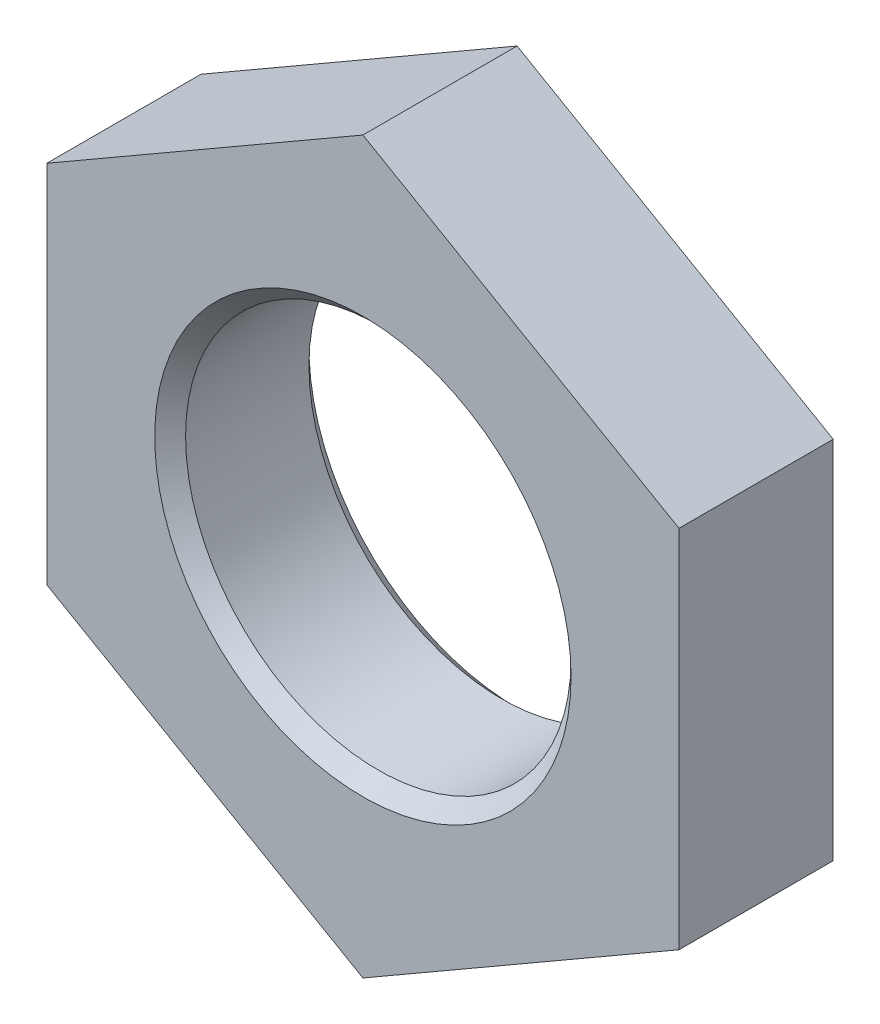
ISO-10303-21;
HEADER;
FILE_DESCRIPTION(('STEP AP214'),'2;1');
FILE_NAME('part.step','',(''),(''),'','','');
FILE_SCHEMA(('AUTOMOTIVE_DESIGN { 1 0 10303 214 1 1 1 1 }'));
ENDSEC;
DATA;
#1=APPLICATION_CONTEXT('core data for automotive mechanical design processes');
#2=APPLICATION_PROTOCOL_DEFINITION('international standard','automotive_design',2000,#1);
#3=PRODUCT_CONTEXT('',#1,'mechanical');
#4=PRODUCT('Part','Part','',(#3));
#5=PRODUCT_RELATED_PRODUCT_CATEGORY('part','',(#4));
#6=PRODUCT_DEFINITION_FORMATION('','',#4);
#7=PRODUCT_DEFINITION_CONTEXT('part definition',#1,'design');
#8=PRODUCT_DEFINITION('design','',#6,#7);
#9=PRODUCT_DEFINITION_SHAPE('','',#8);
#10=(LENGTH_UNIT() NAMED_UNIT(*) SI_UNIT(.MILLI.,.METRE.));
#11=(NAMED_UNIT(*) PLANE_ANGLE_UNIT() SI_UNIT($,.RADIAN.));
#12=(NAMED_UNIT(*) SI_UNIT($,.STERADIAN.) SOLID_ANGLE_UNIT());
#13=UNCERTAINTY_MEASURE_WITH_UNIT(LENGTH_MEASURE(1.E-05),#10,'distance_accuracy_value','');
#14=(GEOMETRIC_REPRESENTATION_CONTEXT(3) GLOBAL_UNCERTAINTY_ASSIGNED_CONTEXT((#13)) GLOBAL_UNIT_ASSIGNED_CONTEXT((#10,
#11,#12)) REPRESENTATION_CONTEXT('',''));
#15=CARTESIAN_POINT('',(0.,0.,0.));
#16=DIRECTION('',(0.,0.,1.));
#17=DIRECTION('',(1.,0.,0.));
#18=AXIS2_PLACEMENT_3D('',#15,#16,#17);
#19=CARTESIAN_POINT('',(0.,0.,2.));
#20=DIRECTION('',(0.,0.,1.));
#21=DIRECTION('',(1.,0.,0.));
#22=AXIS2_PLACEMENT_3D('',#19,#20,#21);
#23=PLANE('',#22);
#24=CARTESIAN_POINT('',(0.,0.,2.));
#25=DIRECTION('',(0.,0.,1.));
#26=DIRECTION('',(1.,0.,0.));
#27=AXIS2_PLACEMENT_3D('',#24,#25,#26);
#28=CIRCLE('',#27,2.7);
#29=CARTESIAN_POINT('',(2.7,0.,2.));
#30=VERTEX_POINT('',#29);
#31=EDGE_CURVE('E11',#30,#30,#28,.F.);
#32=ORIENTED_EDGE('',*,*,#31,.T.);
#33=EDGE_LOOP('',(#32));
#34=FACE_BOUND('',#33,.T.);
#35=DIRECTION('',(-0.866025403784441,0.499999999999995,0.));
#36=VECTOR('',#35,1.);
#37=CARTESIAN_POINT('',(4.09999999999997,2.36713610367751,2.));
#38=LINE('',#37,#36);
#39=CARTESIAN_POINT('',(4.09999999999997,2.36713610367751,2.));
#40=VERTEX_POINT('',#39);
#41=CARTESIAN_POINT('',(0.,4.73427220735493,2.));
#42=VERTEX_POINT('',#41);
#43=EDGE_CURVE('E148',#40,#42,#38,.T.);
#44=ORIENTED_EDGE('',*,*,#43,.T.);
#45=DIRECTION('',(-0.866025403784438,-0.500000000000001,0.));
#46=VECTOR('',#45,1.);
#47=CARTESIAN_POINT('',(0.,4.73427220735493,2.));
#48=LINE('',#47,#46);
#49=CARTESIAN_POINT('',(-4.10000000000001,2.36713610367746,2.));
#50=VERTEX_POINT('',#49);
#51=EDGE_CURVE('E98',#42,#50,#48,.T.);
#52=ORIENTED_EDGE('',*,*,#51,.T.);
#53=DIRECTION('',(0.,-1.,0.));
#54=VECTOR('',#53,1.);
#55=CARTESIAN_POINT('',(-4.10000000000001,2.36713610367746,2.));
#56=LINE('',#55,#54);
#57=CARTESIAN_POINT('',(-4.09999999999999,-2.36713610367749,2.));
#58=VERTEX_POINT('',#57);
#59=EDGE_CURVE('E110',#50,#58,#56,.T.);
#60=ORIENTED_EDGE('',*,*,#59,.T.);
#61=DIRECTION('',(0.866025403784442,-0.499999999999995,0.));
#62=VECTOR('',#61,1.);
#63=CARTESIAN_POINT('',(-4.09999999999999,-2.36713610367749,2.));
#64=LINE('',#63,#62);
#65=CARTESIAN_POINT('',(0.,-4.73427220735493,2.));
#66=VERTEX_POINT('',#65);
#67=EDGE_CURVE('E105',#58,#66,#64,.T.);
#68=ORIENTED_EDGE('',*,*,#67,.T.);
#69=DIRECTION('',(0.866025403784435,0.500000000000007,0.));
#70=VECTOR('',#69,1.);
#71=CARTESIAN_POINT('',(0.,-4.73427220735493,2.));
#72=LINE('',#71,#70);
#73=CARTESIAN_POINT('',(4.10000000000002,-2.36713610367743,2.));
#74=VERTEX_POINT('',#73);
#75=EDGE_CURVE('E108',#66,#74,#72,.T.);
#76=ORIENTED_EDGE('',*,*,#75,.T.);
#77=DIRECTION('',(0.,1.,0.));
#78=VECTOR('',#77,1.);
#79=CARTESIAN_POINT('',(4.10000000000002,-2.36713610367743,2.));
#80=LINE('',#79,#78);
#81=EDGE_CURVE('E60',#74,#40,#80,.T.);
#82=ORIENTED_EDGE('',*,*,#81,.T.);
#83=EDGE_LOOP('',(#44,#52,#60,#68,#76,#82));
#84=FACE_BOUND('',#83,.T.);
#85=ADVANCED_FACE('F41',(#34,#84),#23,.T.);
#86=CARTESIAN_POINT('',(0.,0.,0.));
#87=DIRECTION('',(0.,0.,1.));
#88=DIRECTION('',(1.,0.,0.));
#89=AXIS2_PLACEMENT_3D('',#86,#87,#88);
#90=PLANE('',#89);
#91=CARTESIAN_POINT('',(0.,0.,0.));
#92=DIRECTION('',(0.,0.,1.));
#93=DIRECTION('',(1.,0.,0.));
#94=AXIS2_PLACEMENT_3D('',#91,#92,#93);
#95=CIRCLE('',#94,2.7);
#96=CARTESIAN_POINT('',(2.7,0.,0.));
#97=VERTEX_POINT('',#96);
#98=EDGE_CURVE('E162',#97,#97,#95,.T.);
#99=ORIENTED_EDGE('',*,*,#98,.T.);
#100=EDGE_LOOP('',(#99));
#101=FACE_BOUND('',#100,.T.);
#102=DIRECTION('',(-0.866025403784441,0.499999999999995,0.));
#103=VECTOR('',#102,1.);
#104=CARTESIAN_POINT('',(4.09999999999997,2.36713610367751,0.));
#105=LINE('',#104,#103);
#106=CARTESIAN_POINT('',(4.09999999999997,2.36713610367751,0.));
#107=VERTEX_POINT('',#106);
#108=CARTESIAN_POINT('',(0.,4.73427220735493,0.));
#109=VERTEX_POINT('',#108);
#110=EDGE_CURVE('E132',#107,#109,#105,.T.);
#111=ORIENTED_EDGE('',*,*,#110,.F.);
#112=DIRECTION('',(0.,1.,0.));
#113=VECTOR('',#112,1.);
#114=CARTESIAN_POINT('',(4.10000000000002,-2.36713610367743,0.));
#115=LINE('',#114,#113);
#116=CARTESIAN_POINT('',(4.10000000000002,-2.36713610367743,0.));
#117=VERTEX_POINT('',#116);
#118=EDGE_CURVE('E89',#117,#107,#115,.T.);
#119=ORIENTED_EDGE('',*,*,#118,.F.);
#120=DIRECTION('',(0.866025403784435,0.500000000000007,0.));
#121=VECTOR('',#120,1.);
#122=CARTESIAN_POINT('',(0.,-4.73427220735493,0.));
#123=LINE('',#122,#121);
#124=CARTESIAN_POINT('',(0.,-4.73427220735493,0.));
#125=VERTEX_POINT('',#124);
#126=EDGE_CURVE('E83',#125,#117,#123,.T.);
#127=ORIENTED_EDGE('',*,*,#126,.F.);
#128=DIRECTION('',(0.866025403784442,-0.499999999999995,0.));
#129=VECTOR('',#128,1.);
#130=CARTESIAN_POINT('',(-4.09999999999999,-2.36713610367749,0.));
#131=LINE('',#130,#129);
#132=CARTESIAN_POINT('',(-4.09999999999999,-2.36713610367749,0.));
#133=VERTEX_POINT('',#132);
#134=EDGE_CURVE('E119',#133,#125,#131,.T.);
#135=ORIENTED_EDGE('',*,*,#134,.F.);
#136=DIRECTION('',(0.,-1.,0.));
#137=VECTOR('',#136,1.);
#138=CARTESIAN_POINT('',(-4.10000000000001,2.36713610367746,0.));
#139=LINE('',#138,#137);
#140=CARTESIAN_POINT('',(-4.10000000000001,2.36713610367746,0.));
#141=VERTEX_POINT('',#140);
#142=EDGE_CURVE('E139',#141,#133,#139,.T.);
#143=ORIENTED_EDGE('',*,*,#142,.F.);
#144=DIRECTION('',(-0.866025403784438,-0.500000000000001,0.));
#145=VECTOR('',#144,1.);
#146=CARTESIAN_POINT('',(0.,4.73427220735493,0.));
#147=LINE('',#146,#145);
#148=EDGE_CURVE('E136',#109,#141,#147,.T.);
#149=ORIENTED_EDGE('',*,*,#148,.F.);
#150=EDGE_LOOP('',(#111,#119,#127,#135,#143,#149));
#151=FACE_BOUND('',#150,.T.);
#152=ADVANCED_FACE('F181',(#101,#151),#90,.F.);
#153=CARTESIAN_POINT('',(4.09999999999997,2.36713610367751,2.));
#154=DIRECTION('',(-0.499999999999995,-0.866025403784442,0.));
#155=DIRECTION('',(0.866025403784442,-0.499999999999995,0.));
#156=AXIS2_PLACEMENT_3D('',#153,#154,#155);
#157=PLANE('',#156);
#158=ORIENTED_EDGE('',*,*,#110,.T.);
#159=DIRECTION('',(0.,0.,-1.));
#160=VECTOR('',#159,1.);
#161=CARTESIAN_POINT('',(0.,4.73427220735493,2.));
#162=LINE('',#161,#160);
#163=EDGE_CURVE('E159',#42,#109,#162,.T.);
#164=ORIENTED_EDGE('',*,*,#163,.F.);
#165=ORIENTED_EDGE('',*,*,#43,.F.);
#166=DIRECTION('',(0.,0.,-1.));
#167=VECTOR('',#166,1.);
#168=CARTESIAN_POINT('',(4.09999999999997,2.36713610367751,2.));
#169=LINE('',#168,#167);
#170=EDGE_CURVE('E128',#40,#107,#169,.T.);
#171=ORIENTED_EDGE('',*,*,#170,.T.);
#172=EDGE_LOOP('',(#158,#164,#165,#171));
#173=FACE_BOUND('',#172,.T.);
#174=ADVANCED_FACE('F184',(#173),#157,.F.);
#175=CARTESIAN_POINT('',(0.,4.73427220735493,2.));
#176=DIRECTION('',(0.500000000000001,-0.866025403784438,0.));
#177=DIRECTION('',(0.866025403784438,0.500000000000001,0.));
#178=AXIS2_PLACEMENT_3D('',#175,#176,#177);
#179=PLANE('',#178);
#180=ORIENTED_EDGE('',*,*,#148,.T.);
#181=DIRECTION('',(0.,0.,-1.));
#182=VECTOR('',#181,1.);
#183=CARTESIAN_POINT('',(-4.10000000000001,2.36713610367746,2.));
#184=LINE('',#183,#182);
#185=EDGE_CURVE('E155',#50,#141,#184,.T.);
#186=ORIENTED_EDGE('',*,*,#185,.F.);
#187=ORIENTED_EDGE('',*,*,#51,.F.);
#188=ORIENTED_EDGE('',*,*,#163,.T.);
#189=EDGE_LOOP('',(#180,#186,#187,#188));
#190=FACE_BOUND('',#189,.T.);
#191=ADVANCED_FACE('F260',(#190),#179,.F.);
#192=CARTESIAN_POINT('',(-4.10000000000001,2.36713610367746,2.));
#193=DIRECTION('',(1.,0.,0.));
#194=DIRECTION('',(0.,1.,0.));
#195=AXIS2_PLACEMENT_3D('',#192,#193,#194);
#196=PLANE('',#195);
#197=ORIENTED_EDGE('',*,*,#142,.T.);
#198=DIRECTION('',(0.,0.,-1.));
#199=VECTOR('',#198,1.);
#200=CARTESIAN_POINT('',(-4.09999999999999,-2.36713610367749,2.));
#201=LINE('',#200,#199);
#202=EDGE_CURVE('E121',#58,#133,#201,.T.);
#203=ORIENTED_EDGE('',*,*,#202,.F.);
#204=ORIENTED_EDGE('',*,*,#59,.F.);
#205=ORIENTED_EDGE('',*,*,#185,.T.);
#206=EDGE_LOOP('',(#197,#203,#204,#205));
#207=FACE_BOUND('',#206,.T.);
#208=ADVANCED_FACE('F251',(#207),#196,.F.);
#209=CARTESIAN_POINT('',(-4.09999999999999,-2.36713610367749,2.));
#210=DIRECTION('',(0.499999999999995,0.866025403784442,0.));
#211=DIRECTION('',(-0.866025403784442,0.499999999999995,0.));
#212=AXIS2_PLACEMENT_3D('',#209,#210,#211);
#213=PLANE('',#212);
#214=ORIENTED_EDGE('',*,*,#134,.T.);
#215=DIRECTION('',(0.,0.,-1.));
#216=VECTOR('',#215,1.);
#217=CARTESIAN_POINT('',(0.,-4.73427220735493,2.));
#218=LINE('',#217,#216);
#219=EDGE_CURVE('E116',#66,#125,#218,.T.);
#220=ORIENTED_EDGE('',*,*,#219,.F.);
#221=ORIENTED_EDGE('',*,*,#67,.F.);
#222=ORIENTED_EDGE('',*,*,#202,.T.);
#223=EDGE_LOOP('',(#214,#220,#221,#222));
#224=FACE_BOUND('',#223,.T.);
#225=ADVANCED_FACE('F117',(#224),#213,.F.);
#226=CARTESIAN_POINT('',(0.,-4.73427220735493,2.));
#227=DIRECTION('',(-0.500000000000007,0.866025403784435,0.));
#228=DIRECTION('',(-0.866025403784435,-0.500000000000007,0.));
#229=AXIS2_PLACEMENT_3D('',#226,#227,#228);
#230=PLANE('',#229);
#231=ORIENTED_EDGE('',*,*,#126,.T.);
#232=DIRECTION('',(0.,0.,-1.));
#233=VECTOR('',#232,1.);
#234=CARTESIAN_POINT('',(4.10000000000002,-2.36713610367743,2.));
#235=LINE('',#234,#233);
#236=EDGE_CURVE('E122',#74,#117,#235,.T.);
#237=ORIENTED_EDGE('',*,*,#236,.F.);
#238=ORIENTED_EDGE('',*,*,#75,.F.);
#239=ORIENTED_EDGE('',*,*,#219,.T.);
#240=EDGE_LOOP('',(#231,#237,#238,#239));
#241=FACE_BOUND('',#240,.T.);
#242=ADVANCED_FACE('F124',(#241),#230,.F.);
#243=CARTESIAN_POINT('',(4.10000000000002,-2.36713610367743,2.));
#244=DIRECTION('',(-1.,0.,0.));
#245=DIRECTION('',(0.,-1.,0.));
#246=AXIS2_PLACEMENT_3D('',#243,#244,#245);
#247=PLANE('',#246);
#248=ORIENTED_EDGE('',*,*,#118,.T.);
#249=ORIENTED_EDGE('',*,*,#170,.F.);
#250=ORIENTED_EDGE('',*,*,#81,.F.);
#251=ORIENTED_EDGE('',*,*,#236,.T.);
#252=EDGE_LOOP('',(#248,#249,#250,#251));
#253=FACE_BOUND('',#252,.T.);
#254=ADVANCED_FACE('F191',(#253),#247,.F.);
#255=CARTESIAN_POINT('',(0.,0.,2.));
#256=DIRECTION('',(0.,0.,-1.));
#257=DIRECTION('',(-1.,0.,0.));
#258=AXIS2_PLACEMENT_3D('',#255,#256,#257);
#259=CYLINDRICAL_SURFACE('',#258,2.5);
#260=CARTESIAN_POINT('',(0.,0.,0.199999999999999));
#261=DIRECTION('',(0.,0.,1.));
#262=DIRECTION('',(1.,0.,0.));
#263=AXIS2_PLACEMENT_3D('',#260,#261,#262);
#264=CIRCLE('',#263,2.5);
#265=CARTESIAN_POINT('',(2.5,0.,0.199999999999999));
#266=VERTEX_POINT('',#265);
#267=EDGE_CURVE('E52',#266,#266,#264,.F.);
#268=ORIENTED_EDGE('',*,*,#267,.T.);
#269=EDGE_LOOP('',(#268));
#270=FACE_BOUND('',#269,.T.);
#271=CARTESIAN_POINT('',(0.,0.,1.8));
#272=DIRECTION('',(0.,0.,1.));
#273=DIRECTION('',(1.,0.,0.));
#274=AXIS2_PLACEMENT_3D('',#271,#272,#273);
#275=CIRCLE('',#274,2.5);
#276=CARTESIAN_POINT('',(2.5,0.,1.8));
#277=VERTEX_POINT('',#276);
#278=EDGE_CURVE('E166',#277,#277,#275,.T.);
#279=ORIENTED_EDGE('',*,*,#278,.T.);
#280=EDGE_LOOP('',(#279));
#281=FACE_BOUND('',#280,.T.);
#282=ADVANCED_FACE('F173',(#270,#281),#259,.F.);
#283=CARTESIAN_POINT('',(0.,0.,0.));
#284=DIRECTION('',(0.,0.,-1.));
#285=DIRECTION('',(-1.,0.,0.));
#286=AXIS2_PLACEMENT_3D('',#283,#284,#285);
#287=CONICAL_SURFACE('',#286,2.7,0.785398163397447);
#288=ORIENTED_EDGE('',*,*,#267,.F.);
#289=EDGE_LOOP('',(#288));
#290=FACE_BOUND('',#289,.T.);
#291=ORIENTED_EDGE('',*,*,#98,.F.);
#292=EDGE_LOOP('',(#291));
#293=FACE_BOUND('',#292,.T.);
#294=ADVANCED_FACE('F176',(#290,#293),#287,.F.);
#295=CARTESIAN_POINT('',(0.,0.,1.8));
#296=DIRECTION('',(0.,0.,1.));
#297=DIRECTION('',(1.,0.,0.));
#298=AXIS2_PLACEMENT_3D('',#295,#296,#297);
#299=CONICAL_SURFACE('',#298,2.5,0.785398163397454);
#300=ORIENTED_EDGE('',*,*,#31,.F.);
#301=EDGE_LOOP('',(#300));
#302=FACE_BOUND('',#301,.T.);
#303=ORIENTED_EDGE('',*,*,#278,.F.);
#304=EDGE_LOOP('',(#303));
#305=FACE_BOUND('',#304,.T.);
#306=ADVANCED_FACE('F44',(#302,#305),#299,.F.);
#307=CLOSED_SHELL('',(#85,#152,#174,#191,#208,#225,#242,#254,#282,#294,#306));
#308=MANIFOLD_SOLID_BREP('B2',#307);
#309=ADVANCED_BREP_SHAPE_REPRESENTATION('',(#18,#308),#14);
#310=SHAPE_DEFINITION_REPRESENTATION(#9,#309);
ENDSEC;
END-ISO-10303-21;
